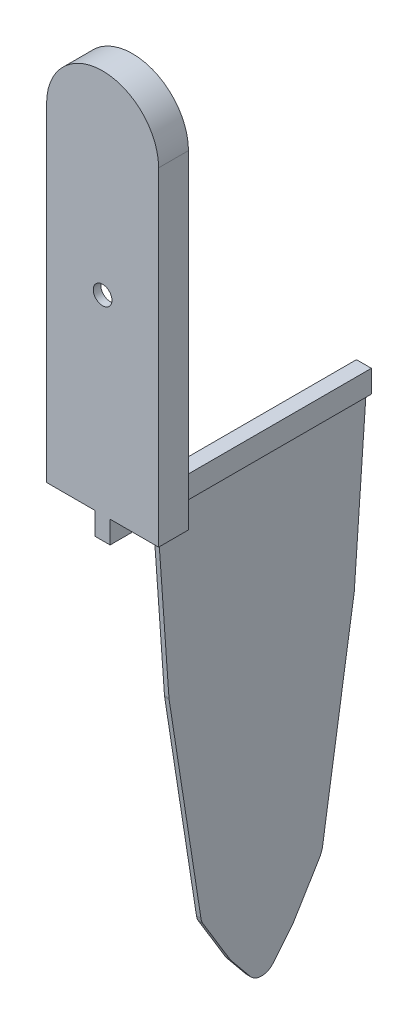
ISO-10303-21;
HEADER;
FILE_DESCRIPTION(('STEP AP214'),'2;1');
FILE_NAME('part.step','',(''),(''),'','','');
FILE_SCHEMA(('AUTOMOTIVE_DESIGN { 1 0 10303 214 1 1 1 1 }'));
ENDSEC;
DATA;
#1=APPLICATION_CONTEXT('core data for automotive mechanical design processes');
#2=APPLICATION_PROTOCOL_DEFINITION('international standard','automotive_design',2000,#1);
#3=PRODUCT_CONTEXT('',#1,'mechanical');
#4=PRODUCT('Part','Part','',(#3));
#5=PRODUCT_RELATED_PRODUCT_CATEGORY('part','',(#4));
#6=PRODUCT_DEFINITION_FORMATION('','',#4);
#7=PRODUCT_DEFINITION_CONTEXT('part definition',#1,'design');
#8=PRODUCT_DEFINITION('design','',#6,#7);
#9=PRODUCT_DEFINITION_SHAPE('','',#8);
#10=(LENGTH_UNIT() NAMED_UNIT(*) SI_UNIT(.MILLI.,.METRE.));
#11=(NAMED_UNIT(*) PLANE_ANGLE_UNIT() SI_UNIT($,.RADIAN.));
#12=(NAMED_UNIT(*) SI_UNIT($,.STERADIAN.) SOLID_ANGLE_UNIT());
#13=UNCERTAINTY_MEASURE_WITH_UNIT(LENGTH_MEASURE(1.E-05),#10,'distance_accuracy_value','');
#14=(GEOMETRIC_REPRESENTATION_CONTEXT(3) GLOBAL_UNCERTAINTY_ASSIGNED_CONTEXT((#13)) GLOBAL_UNIT_ASSIGNED_CONTEXT((#10,
#11,#12)) REPRESENTATION_CONTEXT('',''));
#15=CARTESIAN_POINT('',(0.,0.,0.));
#16=DIRECTION('',(0.,0.,1.));
#17=DIRECTION('',(1.,0.,0.));
#18=AXIS2_PLACEMENT_3D('',#15,#16,#17);
#19=CARTESIAN_POINT('',(-1.,5.,4.));
#20=DIRECTION('',(0.,-1.,0.));
#21=DIRECTION('',(0.,0.,-1.));
#22=AXIS2_PLACEMENT_3D('',#19,#20,#21);
#23=PLANE('',#22);
#24=DIRECTION('',(1.,0.,0.));
#25=VECTOR('',#24,1.);
#26=CARTESIAN_POINT('',(-1.,5.,-31.));
#27=LINE('',#26,#25);
#28=CARTESIAN_POINT('',(-1.,5.,-31.));
#29=VERTEX_POINT('',#28);
#30=CARTESIAN_POINT('',(-0.3,5.,-31.));
#31=VERTEX_POINT('',#30);
#32=EDGE_CURVE('E311',#29,#31,#27,.T.);
#33=ORIENTED_EDGE('',*,*,#32,.T.);
#34=DIRECTION('',(0.,0.,1.));
#35=VECTOR('',#34,1.);
#36=CARTESIAN_POINT('',(-0.3,5.,-3.));
#37=LINE('',#36,#35);
#38=CARTESIAN_POINT('',(-0.3,5.,-3.));
#39=VERTEX_POINT('',#38);
#40=EDGE_CURVE('E60',#31,#39,#37,.T.);
#41=ORIENTED_EDGE('',*,*,#40,.T.);
#42=DIRECTION('',(-1.,0.,0.));
#43=VECTOR('',#42,1.);
#44=CARTESIAN_POINT('',(0.3,5.,-3.));
#45=LINE('',#44,#43);
#46=CARTESIAN_POINT('',(0.3,5.,-3.));
#47=VERTEX_POINT('',#46);
#48=EDGE_CURVE('E863',#47,#39,#45,.T.);
#49=ORIENTED_EDGE('',*,*,#48,.F.);
#50=DIRECTION('',(0.,0.,1.));
#51=VECTOR('',#50,1.);
#52=CARTESIAN_POINT('',(0.3,5.,-3.));
#53=LINE('',#52,#51);
#54=CARTESIAN_POINT('',(0.3,5.,-31.));
#55=VERTEX_POINT('',#54);
#56=EDGE_CURVE('E66',#55,#47,#53,.T.);
#57=ORIENTED_EDGE('',*,*,#56,.F.);
#58=CARTESIAN_POINT('',(1.,5.,-31.));
#59=VERTEX_POINT('',#58);
#60=EDGE_CURVE('E314',#55,#59,#27,.T.);
#61=ORIENTED_EDGE('',*,*,#60,.T.);
#62=DIRECTION('',(0.,0.,-1.));
#63=VECTOR('',#62,1.);
#64=CARTESIAN_POINT('',(1.,5.,4.));
#65=LINE('',#64,#63);
#66=CARTESIAN_POINT('',(1.,5.,4.));
#67=VERTEX_POINT('',#66);
#68=EDGE_CURVE('E276',#67,#59,#65,.T.);
#69=ORIENTED_EDGE('',*,*,#68,.F.);
#70=DIRECTION('',(1.,0.,0.));
#71=VECTOR('',#70,1.);
#72=CARTESIAN_POINT('',(-1.,5.,4.));
#73=LINE('',#72,#71);
#74=CARTESIAN_POINT('',(-1.,5.,4.));
#75=VERTEX_POINT('',#74);
#76=EDGE_CURVE('E307',#75,#67,#73,.T.);
#77=ORIENTED_EDGE('',*,*,#76,.F.);
#78=DIRECTION('',(0.,0.,-1.));
#79=VECTOR('',#78,1.);
#80=CARTESIAN_POINT('',(-1.,5.,4.));
#81=LINE('',#80,#79);
#82=EDGE_CURVE('E295',#75,#29,#81,.T.);
#83=ORIENTED_EDGE('',*,*,#82,.T.);
#84=EDGE_LOOP('',(#33,#41,#49,#57,#61,#69,#77,#83));
#85=FACE_BOUND('',#84,.T.);
#86=ADVANCED_FACE('F41',(#85),#23,.T.);
#87=CARTESIAN_POINT('',(-7.5,8.,4.));
#88=DIRECTION('',(0.,1.,0.));
#89=DIRECTION('',(0.,0.,1.));
#90=AXIS2_PLACEMENT_3D('',#87,#88,#89);
#91=PLANE('',#90);
#92=DIRECTION('',(0.,0.,1.));
#93=VECTOR('',#92,1.);
#94=CARTESIAN_POINT('',(1.,8.,4.));
#95=LINE('',#94,#93);
#96=CARTESIAN_POINT('',(1.,8.,0.));
#97=VERTEX_POINT('',#96);
#98=CARTESIAN_POINT('',(1.,8.,4.));
#99=VERTEX_POINT('',#98);
#100=EDGE_CURVE('E11',#97,#99,#95,.T.);
#101=ORIENTED_EDGE('',*,*,#100,.F.);
#102=DIRECTION('',(1.,0.,0.));
#103=VECTOR('',#102,1.);
#104=CARTESIAN_POINT('',(-7.5,8.,0.));
#105=LINE('',#104,#103);
#106=CARTESIAN_POINT('',(7.5,8.,0.));
#107=VERTEX_POINT('',#106);
#108=EDGE_CURVE('E407',#97,#107,#105,.T.);
#109=ORIENTED_EDGE('',*,*,#108,.T.);
#110=DIRECTION('',(0.,0.,-1.));
#111=VECTOR('',#110,1.);
#112=CARTESIAN_POINT('',(7.5,8.,4.));
#113=LINE('',#112,#111);
#114=CARTESIAN_POINT('',(7.5,8.,4.));
#115=VERTEX_POINT('',#114);
#116=EDGE_CURVE('E418',#115,#107,#113,.T.);
#117=ORIENTED_EDGE('',*,*,#116,.F.);
#118=DIRECTION('',(1.,0.,0.));
#119=VECTOR('',#118,1.);
#120=CARTESIAN_POINT('',(-7.5,8.,4.));
#121=LINE('',#120,#119);
#122=EDGE_CURVE('E392',#99,#115,#121,.T.);
#123=ORIENTED_EDGE('',*,*,#122,.F.);
#124=EDGE_LOOP('',(#101,#109,#117,#123));
#125=FACE_BOUND('',#124,.T.);
#126=ADVANCED_FACE('F456',(#125),#91,.F.);
#127=CARTESIAN_POINT('',(0.,52.,4.));
#128=DIRECTION('',(0.,0.,-1.));
#129=DIRECTION('',(-1.,0.,0.));
#130=AXIS2_PLACEMENT_3D('',#127,#128,#129);
#131=CYLINDRICAL_SURFACE('',#130,7.5);
#132=CARTESIAN_POINT('',(0.,52.,0.));
#133=DIRECTION('',(0.,0.,1.));
#134=DIRECTION('',(1.,0.,0.));
#135=AXIS2_PLACEMENT_3D('',#132,#133,#134);
#136=CIRCLE('',#135,7.5);
#137=CARTESIAN_POINT('',(7.5,52.,0.));
#138=VERTEX_POINT('',#137);
#139=CARTESIAN_POINT('',(-7.5,52.,0.));
#140=VERTEX_POINT('',#139);
#141=EDGE_CURVE('E383',#138,#140,#136,.T.);
#142=ORIENTED_EDGE('',*,*,#141,.T.);
#143=DIRECTION('',(0.,0.,-1.));
#144=VECTOR('',#143,1.);
#145=CARTESIAN_POINT('',(-7.5,52.,4.));
#146=LINE('',#145,#144);
#147=CARTESIAN_POINT('',(-7.5,52.,4.));
#148=VERTEX_POINT('',#147);
#149=EDGE_CURVE('E425',#148,#140,#146,.T.);
#150=ORIENTED_EDGE('',*,*,#149,.F.);
#151=CARTESIAN_POINT('',(0.,52.,4.));
#152=DIRECTION('',(0.,0.,1.));
#153=DIRECTION('',(1.,0.,0.));
#154=AXIS2_PLACEMENT_3D('',#151,#152,#153);
#155=CIRCLE('',#154,7.5);
#156=CARTESIAN_POINT('',(7.5,52.,4.));
#157=VERTEX_POINT('',#156);
#158=EDGE_CURVE('E384',#157,#148,#155,.T.);
#159=ORIENTED_EDGE('',*,*,#158,.F.);
#160=DIRECTION('',(0.,0.,-1.));
#161=VECTOR('',#160,1.);
#162=CARTESIAN_POINT('',(7.5,52.,4.));
#163=LINE('',#162,#161);
#164=EDGE_CURVE('E400',#157,#138,#163,.T.);
#165=ORIENTED_EDGE('',*,*,#164,.T.);
#166=EDGE_LOOP('',(#142,#150,#159,#165));
#167=FACE_BOUND('',#166,.T.);
#168=ADVANCED_FACE('F43',(#167),#131,.T.);
#169=CARTESIAN_POINT('',(-7.5,8.,4.));
#170=DIRECTION('',(1.,0.,0.));
#171=DIRECTION('',(0.,0.,-1.));
#172=AXIS2_PLACEMENT_3D('',#169,#170,#171);
#173=PLANE('',#172);
#174=DIRECTION('',(0.,-1.,0.));
#175=VECTOR('',#174,1.);
#176=CARTESIAN_POINT('',(-7.5,8.,0.));
#177=LINE('',#176,#175);
#178=CARTESIAN_POINT('',(-7.5,8.,0.));
#179=VERTEX_POINT('',#178);
#180=EDGE_CURVE('E404',#140,#179,#177,.T.);
#181=ORIENTED_EDGE('',*,*,#180,.T.);
#182=DIRECTION('',(0.,0.,-1.));
#183=VECTOR('',#182,1.);
#184=CARTESIAN_POINT('',(-7.5,8.,4.));
#185=LINE('',#184,#183);
#186=CARTESIAN_POINT('',(-7.5,8.,4.));
#187=VERTEX_POINT('',#186);
#188=EDGE_CURVE('E422',#187,#179,#185,.T.);
#189=ORIENTED_EDGE('',*,*,#188,.F.);
#190=DIRECTION('',(0.,-1.,0.));
#191=VECTOR('',#190,1.);
#192=CARTESIAN_POINT('',(-7.5,8.,4.));
#193=LINE('',#192,#191);
#194=EDGE_CURVE('E388',#148,#187,#193,.T.);
#195=ORIENTED_EDGE('',*,*,#194,.F.);
#196=ORIENTED_EDGE('',*,*,#149,.T.);
#197=EDGE_LOOP('',(#181,#189,#195,#196));
#198=FACE_BOUND('',#197,.T.);
#199=ADVANCED_FACE('F442',(#198),#173,.F.);
#200=CARTESIAN_POINT('',(-1.,8.,0.));
#201=VERTEX_POINT('',#200);
#202=EDGE_CURVE('E408',#179,#201,#105,.T.);
#203=ORIENTED_EDGE('',*,*,#202,.T.);
#204=DIRECTION('',(0.,0.,1.));
#205=VECTOR('',#204,1.);
#206=CARTESIAN_POINT('',(-1.,8.,4.));
#207=LINE('',#206,#205);
#208=CARTESIAN_POINT('',(-1.,8.,4.));
#209=VERTEX_POINT('',#208);
#210=EDGE_CURVE('E51',#201,#209,#207,.T.);
#211=ORIENTED_EDGE('',*,*,#210,.T.);
#212=EDGE_CURVE('E393',#187,#209,#121,.T.);
#213=ORIENTED_EDGE('',*,*,#212,.F.);
#214=ORIENTED_EDGE('',*,*,#188,.T.);
#215=EDGE_LOOP('',(#203,#211,#213,#214));
#216=FACE_BOUND('',#215,.T.);
#217=ADVANCED_FACE('F434',(#216),#91,.F.);
#218=CARTESIAN_POINT('',(7.5,8.,4.));
#219=DIRECTION('',(-1.,0.,0.));
#220=DIRECTION('',(0.,0.,1.));
#221=AXIS2_PLACEMENT_3D('',#218,#219,#220);
#222=PLANE('',#221);
#223=DIRECTION('',(0.,1.,0.));
#224=VECTOR('',#223,1.);
#225=CARTESIAN_POINT('',(7.5,8.,0.));
#226=LINE('',#225,#224);
#227=EDGE_CURVE('E389',#107,#138,#226,.T.);
#228=ORIENTED_EDGE('',*,*,#227,.T.);
#229=ORIENTED_EDGE('',*,*,#164,.F.);
#230=DIRECTION('',(0.,1.,0.));
#231=VECTOR('',#230,1.);
#232=CARTESIAN_POINT('',(7.5,8.,4.));
#233=LINE('',#232,#231);
#234=EDGE_CURVE('E397',#115,#157,#233,.T.);
#235=ORIENTED_EDGE('',*,*,#234,.F.);
#236=ORIENTED_EDGE('',*,*,#116,.T.);
#237=EDGE_LOOP('',(#228,#229,#235,#236));
#238=FACE_BOUND('',#237,.T.);
#239=ADVANCED_FACE('F460',(#238),#222,.F.);
#240=CARTESIAN_POINT('',(0.,52.,4.));
#241=DIRECTION('',(0.,0.,1.));
#242=DIRECTION('',(1.,0.,0.));
#243=AXIS2_PLACEMENT_3D('',#240,#241,#242);
#244=PLANE('',#243);
#245=CARTESIAN_POINT('',(0.,33.5,4.));
#246=DIRECTION('',(0.,0.,1.));
#247=DIRECTION('',(1.,0.,0.));
#248=AXIS2_PLACEMENT_3D('',#245,#246,#247);
#249=CIRCLE('',#248,1.25);
#250=CARTESIAN_POINT('',(1.25,33.5,4.));
#251=VERTEX_POINT('',#250);
#252=EDGE_CURVE('E317',#251,#251,#249,.F.);
#253=ORIENTED_EDGE('',*,*,#252,.T.);
#254=EDGE_LOOP('',(#253));
#255=FACE_BOUND('',#254,.T.);
#256=ORIENTED_EDGE('',*,*,#158,.T.);
#257=ORIENTED_EDGE('',*,*,#194,.T.);
#258=ORIENTED_EDGE('',*,*,#212,.T.);
#259=DIRECTION('',(0.,-1.,0.));
#260=VECTOR('',#259,1.);
#261=CARTESIAN_POINT('',(-1.,8.,4.));
#262=LINE('',#261,#260);
#263=EDGE_CURVE('E291',#209,#75,#262,.T.);
#264=ORIENTED_EDGE('',*,*,#263,.T.);
#265=ORIENTED_EDGE('',*,*,#76,.T.);
#266=DIRECTION('',(0.,-1.,0.));
#267=VECTOR('',#266,1.);
#268=CARTESIAN_POINT('',(1.,8.,4.));
#269=LINE('',#268,#267);
#270=EDGE_CURVE('E271',#99,#67,#269,.T.);
#271=ORIENTED_EDGE('',*,*,#270,.F.);
#272=ORIENTED_EDGE('',*,*,#122,.T.);
#273=ORIENTED_EDGE('',*,*,#234,.T.);
#274=EDGE_LOOP('',(#256,#257,#258,#264,#265,#271,#272,#273));
#275=FACE_BOUND('',#274,.T.);
#276=ADVANCED_FACE('F439',(#255,#275),#244,.T.);
#277=CARTESIAN_POINT('',(0.,52.,0.));
#278=DIRECTION('',(0.,0.,1.));
#279=DIRECTION('',(1.,0.,0.));
#280=AXIS2_PLACEMENT_3D('',#277,#278,#279);
#281=PLANE('',#280);
#282=DIRECTION('',(-0.161684528353419,0.986842496699009,0.));
#283=VECTOR('',#282,1.);
#284=CARTESIAN_POINT('',(10.214455548325,1.67353902293651,0.));
#285=LINE('',#284,#283);
#286=CARTESIAN_POINT('',(5.,33.5,0.));
#287=VERTEX_POINT('',#286);
#288=CARTESIAN_POINT('',(2.29663575823377,50.,0.));
#289=VERTEX_POINT('',#288);
#290=EDGE_CURVE('E327',#287,#289,#285,.T.);
#291=ORIENTED_EDGE('',*,*,#290,.T.);
#292=CARTESIAN_POINT('',(0.,50.,0.));
#293=DIRECTION('',(0.,0.,1.));
#294=DIRECTION('',(1.,0.,0.));
#295=AXIS2_PLACEMENT_3D('',#292,#293,#294);
#296=CIRCLE('',#295,2.29663575823377);
#297=CARTESIAN_POINT('',(-2.29663575823377,50.,0.));
#298=VERTEX_POINT('',#297);
#299=EDGE_CURVE('E321',#298,#289,#296,.F.);
#300=ORIENTED_EDGE('',*,*,#299,.F.);
#301=DIRECTION('',(-0.161684528353419,-0.986842496699009,0.));
#302=VECTOR('',#301,1.);
#303=CARTESIAN_POINT('',(-10.214455548325,1.67353902293651,0.));
#304=LINE('',#303,#302);
#305=CARTESIAN_POINT('',(-5.,33.5,0.));
#306=VERTEX_POINT('',#305);
#307=EDGE_CURVE('E346',#298,#306,#304,.T.);
#308=ORIENTED_EDGE('',*,*,#307,.T.);
#309=DIRECTION('',(0.161380696641222,-0.986892228539466,0.));
#310=VECTOR('',#309,1.);
#311=CARTESIAN_POINT('',(0.465608050517505,0.0761381530640669,0.));
#312=LINE('',#311,#310);
#313=CARTESIAN_POINT('',(-2.30185179538713,17.,0.));
#314=VERTEX_POINT('',#313);
#315=EDGE_CURVE('E350',#306,#314,#312,.T.);
#316=ORIENTED_EDGE('',*,*,#315,.T.);
#317=CARTESIAN_POINT('',(0.,17.,0.));
#318=DIRECTION('',(0.,0.,1.));
#319=DIRECTION('',(1.,0.,0.));
#320=AXIS2_PLACEMENT_3D('',#317,#318,#319);
#321=CIRCLE('',#320,2.30185179538713);
#322=CARTESIAN_POINT('',(2.27233199291966,16.6325370741411,0.));
#323=VERTEX_POINT('',#322);
#324=EDGE_CURVE('E354',#314,#323,#321,.T.);
#325=ORIENTED_EDGE('',*,*,#324,.T.);
#326=DIRECTION('',(-0.159637960443524,-0.987175628541057,0.));
#327=VECTOR('',#326,1.);
#328=CARTESIAN_POINT('',(-0.40670997405777,0.0657698071887931,0.));
#329=LINE('',#328,#327);
#330=EDGE_CURVE('E358',#287,#323,#329,.T.);
#331=ORIENTED_EDGE('',*,*,#330,.F.);
#332=EDGE_LOOP('',(#291,#300,#308,#316,#325,#331));
#333=FACE_BOUND('',#332,.T.);
#334=ORIENTED_EDGE('',*,*,#141,.F.);
#335=ORIENTED_EDGE('',*,*,#227,.F.);
#336=ORIENTED_EDGE('',*,*,#108,.F.);
#337=EDGE_CURVE('E412',#201,#97,#105,.T.);
#338=ORIENTED_EDGE('',*,*,#337,.F.);
#339=ORIENTED_EDGE('',*,*,#202,.F.);
#340=ORIENTED_EDGE('',*,*,#180,.F.);
#341=EDGE_LOOP('',(#334,#335,#336,#338,#339,#340));
#342=FACE_BOUND('',#341,.T.);
#343=ADVANCED_FACE('F446',(#333,#342),#281,.F.);
#344=CARTESIAN_POINT('',(0.,50.,3.));
#345=DIRECTION('',(0.,0.,-1.));
#346=DIRECTION('',(-1.,0.,0.));
#347=AXIS2_PLACEMENT_3D('',#344,#345,#346);
#348=CYLINDRICAL_SURFACE('',#347,2.29663575823377);
#349=ORIENTED_EDGE('',*,*,#299,.T.);
#350=DIRECTION('',(0.,0.,-1.));
#351=VECTOR('',#350,1.);
#352=CARTESIAN_POINT('',(2.29663575823377,50.,3.));
#353=LINE('',#352,#351);
#354=CARTESIAN_POINT('',(2.29663575823377,50.,3.));
#355=VERTEX_POINT('',#354);
#356=EDGE_CURVE('E343',#355,#289,#353,.T.);
#357=ORIENTED_EDGE('',*,*,#356,.F.);
#358=CARTESIAN_POINT('',(0.,50.,3.));
#359=DIRECTION('',(0.,0.,1.));
#360=DIRECTION('',(1.,0.,0.));
#361=AXIS2_PLACEMENT_3D('',#358,#359,#360);
#362=CIRCLE('',#361,2.29663575823377);
#363=CARTESIAN_POINT('',(-2.29663575823377,50.,3.));
#364=VERTEX_POINT('',#363);
#365=EDGE_CURVE('E322',#364,#355,#362,.F.);
#366=ORIENTED_EDGE('',*,*,#365,.F.);
#367=DIRECTION('',(0.,0.,-1.));
#368=VECTOR('',#367,1.);
#369=CARTESIAN_POINT('',(-2.29663575823377,50.,3.));
#370=LINE('',#369,#368);
#371=EDGE_CURVE('E380',#364,#298,#370,.T.);
#372=ORIENTED_EDGE('',*,*,#371,.T.);
#373=EDGE_LOOP('',(#349,#357,#366,#372));
#374=FACE_BOUND('',#373,.T.);
#375=ADVANCED_FACE('F505',(#374),#348,.F.);
#376=CARTESIAN_POINT('',(-10.214455548325,1.67353902293651,3.));
#377=DIRECTION('',(0.986842496699008,-0.161684528353419,0.));
#378=DIRECTION('',(0.161684528353419,0.986842496699008,0.));
#379=AXIS2_PLACEMENT_3D('',#376,#377,#378);
#380=PLANE('',#379);
#381=ORIENTED_EDGE('',*,*,#307,.F.);
#382=ORIENTED_EDGE('',*,*,#371,.F.);
#383=DIRECTION('',(-0.161684528353419,-0.986842496699009,0.));
#384=VECTOR('',#383,1.);
#385=CARTESIAN_POINT('',(-10.214455548325,1.67353902293651,3.));
#386=LINE('',#385,#384);
#387=CARTESIAN_POINT('',(-5.,33.5,3.));
#388=VERTEX_POINT('',#387);
#389=EDGE_CURVE('E326',#364,#388,#386,.T.);
#390=ORIENTED_EDGE('',*,*,#389,.T.);
#391=DIRECTION('',(0.,0.,-1.));
#392=VECTOR('',#391,1.);
#393=CARTESIAN_POINT('',(-5.,33.5,3.));
#394=LINE('',#393,#392);
#395=EDGE_CURVE('E377',#388,#306,#394,.T.);
#396=ORIENTED_EDGE('',*,*,#395,.T.);
#397=EDGE_LOOP('',(#381,#382,#390,#396));
#398=FACE_BOUND('',#397,.T.);
#399=ADVANCED_FACE('F501',(#398),#380,.T.);
#400=CARTESIAN_POINT('',(0.465608050517505,0.0761381530640669,3.));
#401=DIRECTION('',(0.986892228539466,0.161380696641222,0.));
#402=DIRECTION('',(-0.161380696641222,0.986892228539466,0.));
#403=AXIS2_PLACEMENT_3D('',#400,#401,#402);
#404=PLANE('',#403);
#405=ORIENTED_EDGE('',*,*,#315,.F.);
#406=ORIENTED_EDGE('',*,*,#395,.F.);
#407=DIRECTION('',(0.161380696641222,-0.986892228539466,0.));
#408=VECTOR('',#407,1.);
#409=CARTESIAN_POINT('',(0.465608050517505,0.0761381530640669,3.));
#410=LINE('',#409,#408);
#411=CARTESIAN_POINT('',(-2.30185179538713,17.,3.));
#412=VERTEX_POINT('',#411);
#413=EDGE_CURVE('E330',#388,#412,#410,.T.);
#414=ORIENTED_EDGE('',*,*,#413,.T.);
#415=DIRECTION('',(0.,0.,-1.));
#416=VECTOR('',#415,1.);
#417=CARTESIAN_POINT('',(-2.30185179538713,17.,3.));
#418=LINE('',#417,#416);
#419=EDGE_CURVE('E374',#412,#314,#418,.T.);
#420=ORIENTED_EDGE('',*,*,#419,.T.);
#421=EDGE_LOOP('',(#405,#406,#414,#420));
#422=FACE_BOUND('',#421,.T.);
#423=ADVANCED_FACE('F497',(#422),#404,.T.);
#424=CARTESIAN_POINT('',(0.,17.,3.));
#425=DIRECTION('',(0.,0.,-1.));
#426=DIRECTION('',(-1.,0.,0.));
#427=AXIS2_PLACEMENT_3D('',#424,#425,#426);
#428=CYLINDRICAL_SURFACE('',#427,2.30185179538713);
#429=ORIENTED_EDGE('',*,*,#324,.F.);
#430=ORIENTED_EDGE('',*,*,#419,.F.);
#431=CARTESIAN_POINT('',(0.,17.,3.));
#432=DIRECTION('',(0.,0.,1.));
#433=DIRECTION('',(1.,0.,0.));
#434=AXIS2_PLACEMENT_3D('',#431,#432,#433);
#435=CIRCLE('',#434,2.30185179538713);
#436=CARTESIAN_POINT('',(2.27233199291966,16.6325370741411,3.));
#437=VERTEX_POINT('',#436);
#438=EDGE_CURVE('E333',#412,#437,#435,.T.);
#439=ORIENTED_EDGE('',*,*,#438,.T.);
#440=DIRECTION('',(0.,0.,-1.));
#441=VECTOR('',#440,1.);
#442=CARTESIAN_POINT('',(2.27233199291966,16.6325370741411,3.));
#443=LINE('',#442,#441);
#444=EDGE_CURVE('E371',#437,#323,#443,.T.);
#445=ORIENTED_EDGE('',*,*,#444,.T.);
#446=EDGE_LOOP('',(#429,#430,#439,#445));
#447=FACE_BOUND('',#446,.T.);
#448=ADVANCED_FACE('F493',(#447),#428,.F.);
#449=CARTESIAN_POINT('',(-0.40670997405777,0.0657698071887931,3.));
#450=DIRECTION('',(0.987175628541057,-0.159637960443524,0.));
#451=DIRECTION('',(0.159637960443524,0.987175628541057,0.));
#452=AXIS2_PLACEMENT_3D('',#449,#450,#451);
#453=PLANE('',#452);
#454=ORIENTED_EDGE('',*,*,#330,.T.);
#455=ORIENTED_EDGE('',*,*,#444,.F.);
#456=DIRECTION('',(-0.159637960443524,-0.987175628541057,0.));
#457=VECTOR('',#456,1.);
#458=CARTESIAN_POINT('',(-0.40670997405777,0.0657698071887931,3.));
#459=LINE('',#458,#457);
#460=CARTESIAN_POINT('',(5.,33.5,3.));
#461=VERTEX_POINT('',#460);
#462=EDGE_CURVE('E336',#461,#437,#459,.T.);
#463=ORIENTED_EDGE('',*,*,#462,.F.);
#464=DIRECTION('',(0.,0.,-1.));
#465=VECTOR('',#464,1.);
#466=CARTESIAN_POINT('',(5.,33.5,3.));
#467=LINE('',#466,#465);
#468=EDGE_CURVE('E368',#461,#287,#467,.T.);
#469=ORIENTED_EDGE('',*,*,#468,.T.);
#470=EDGE_LOOP('',(#454,#455,#463,#469));
#471=FACE_BOUND('',#470,.T.);
#472=ADVANCED_FACE('F489',(#471),#453,.F.);
#473=CARTESIAN_POINT('',(10.214455548325,1.67353902293651,3.));
#474=DIRECTION('',(-0.986842496699008,-0.161684528353419,0.));
#475=DIRECTION('',(0.161684528353419,-0.986842496699008,0.));
#476=AXIS2_PLACEMENT_3D('',#473,#474,#475);
#477=PLANE('',#476);
#478=ORIENTED_EDGE('',*,*,#290,.F.);
#479=ORIENTED_EDGE('',*,*,#468,.F.);
#480=DIRECTION('',(-0.161684528353419,0.986842496699009,0.));
#481=VECTOR('',#480,1.);
#482=CARTESIAN_POINT('',(10.214455548325,1.67353902293651,3.));
#483=LINE('',#482,#481);
#484=EDGE_CURVE('E340',#461,#355,#483,.T.);
#485=ORIENTED_EDGE('',*,*,#484,.T.);
#486=ORIENTED_EDGE('',*,*,#356,.T.);
#487=EDGE_LOOP('',(#478,#479,#485,#486));
#488=FACE_BOUND('',#487,.T.);
#489=ADVANCED_FACE('F485',(#488),#477,.T.);
#490=CARTESIAN_POINT('',(0.,0.,3.));
#491=DIRECTION('',(0.,0.,1.));
#492=DIRECTION('',(1.,0.,0.));
#493=AXIS2_PLACEMENT_3D('',#490,#491,#492);
#494=PLANE('',#493);
#495=CARTESIAN_POINT('',(0.,33.5,3.));
#496=DIRECTION('',(0.,0.,1.));
#497=DIRECTION('',(1.,0.,0.));
#498=AXIS2_PLACEMENT_3D('',#495,#496,#497);
#499=CIRCLE('',#498,1.25);
#500=CARTESIAN_POINT('',(1.25,33.5,3.));
#501=VERTEX_POINT('',#500);
#502=EDGE_CURVE('E45',#501,#501,#499,.F.);
#503=ORIENTED_EDGE('',*,*,#502,.F.);
#504=EDGE_LOOP('',(#503));
#505=FACE_BOUND('',#504,.T.);
#506=ORIENTED_EDGE('',*,*,#365,.T.);
#507=ORIENTED_EDGE('',*,*,#484,.F.);
#508=ORIENTED_EDGE('',*,*,#462,.T.);
#509=ORIENTED_EDGE('',*,*,#438,.F.);
#510=ORIENTED_EDGE('',*,*,#413,.F.);
#511=ORIENTED_EDGE('',*,*,#389,.F.);
#512=EDGE_LOOP('',(#506,#507,#508,#509,#510,#511));
#513=FACE_BOUND('',#512,.T.);
#514=ADVANCED_FACE('F481',(#505,#513),#494,.F.);
#515=CARTESIAN_POINT('',(0.,33.5,12.4));
#516=DIRECTION('',(0.,0.,-1.));
#517=DIRECTION('',(-1.,0.,0.));
#518=AXIS2_PLACEMENT_3D('',#515,#516,#517);
#519=CYLINDRICAL_SURFACE('',#518,1.25);
#520=ORIENTED_EDGE('',*,*,#252,.F.);
#521=EDGE_LOOP('',(#520));
#522=FACE_BOUND('',#521,.T.);
#523=ORIENTED_EDGE('',*,*,#502,.T.);
#524=EDGE_LOOP('',(#523));
#525=FACE_BOUND('',#524,.T.);
#526=ADVANCED_FACE('F477',(#522,#525),#519,.F.);
#527=CARTESIAN_POINT('',(-1.,8.,4.));
#528=DIRECTION('',(0.,1.,0.));
#529=DIRECTION('',(0.,0.,1.));
#530=AXIS2_PLACEMENT_3D('',#527,#528,#529);
#531=PLANE('',#530);
#532=CARTESIAN_POINT('',(-1.,8.,-31.));
#533=VERTEX_POINT('',#532);
#534=EDGE_CURVE('E303',#533,#201,#207,.T.);
#535=ORIENTED_EDGE('',*,*,#534,.T.);
#536=ORIENTED_EDGE('',*,*,#337,.T.);
#537=CARTESIAN_POINT('',(1.,8.,-31.));
#538=VERTEX_POINT('',#537);
#539=EDGE_CURVE('E53',#538,#97,#95,.T.);
#540=ORIENTED_EDGE('',*,*,#539,.F.);
#541=DIRECTION('',(1.,0.,0.));
#542=VECTOR('',#541,1.);
#543=CARTESIAN_POINT('',(-1.,8.,-31.));
#544=LINE('',#543,#542);
#545=EDGE_CURVE('E308',#533,#538,#544,.T.);
#546=ORIENTED_EDGE('',*,*,#545,.F.);
#547=EDGE_LOOP('',(#535,#536,#540,#546));
#548=FACE_BOUND('',#547,.T.);
#549=ADVANCED_FACE('F480',(#548),#531,.T.);
#550=CARTESIAN_POINT('',(-1.,8.,-31.));
#551=DIRECTION('',(0.,0.,-1.));
#552=DIRECTION('',(-1.,0.,0.));
#553=AXIS2_PLACEMENT_3D('',#550,#551,#552);
#554=PLANE('',#553);
#555=ORIENTED_EDGE('',*,*,#545,.T.);
#556=DIRECTION('',(0.,1.,0.));
#557=VECTOR('',#556,1.);
#558=CARTESIAN_POINT('',(1.,8.,-31.));
#559=LINE('',#558,#557);
#560=EDGE_CURVE('E285',#59,#538,#559,.T.);
#561=ORIENTED_EDGE('',*,*,#560,.F.);
#562=ORIENTED_EDGE('',*,*,#60,.F.);
#563=DIRECTION('',(-1.,0.,0.));
#564=VECTOR('',#563,1.);
#565=CARTESIAN_POINT('',(0.3,5.,-31.));
#566=LINE('',#565,#564);
#567=EDGE_CURVE('E866',#55,#31,#566,.T.);
#568=ORIENTED_EDGE('',*,*,#567,.T.);
#569=ORIENTED_EDGE('',*,*,#32,.F.);
#570=DIRECTION('',(0.,1.,0.));
#571=VECTOR('',#570,1.);
#572=CARTESIAN_POINT('',(-1.,8.,-31.));
#573=LINE('',#572,#571);
#574=EDGE_CURVE('E299',#29,#533,#573,.T.);
#575=ORIENTED_EDGE('',*,*,#574,.T.);
#576=EDGE_LOOP('',(#555,#561,#562,#568,#569,#575));
#577=FACE_BOUND('',#576,.T.);
#578=ADVANCED_FACE('F475',(#577),#554,.T.);
#579=CARTESIAN_POINT('',(-1.,0.,0.));
#580=DIRECTION('',(1.,0.,0.));
#581=DIRECTION('',(0.,0.,-1.));
#582=AXIS2_PLACEMENT_3D('',#579,#580,#581);
#583=PLANE('',#582);
#584=ORIENTED_EDGE('',*,*,#263,.F.);
#585=ORIENTED_EDGE('',*,*,#210,.F.);
#586=ORIENTED_EDGE('',*,*,#534,.F.);
#587=ORIENTED_EDGE('',*,*,#574,.F.);
#588=ORIENTED_EDGE('',*,*,#82,.F.);
#589=EDGE_LOOP('',(#584,#585,#586,#587,#588));
#590=FACE_BOUND('',#589,.T.);
#591=ADVANCED_FACE('F579',(#590),#583,.F.);
#592=CARTESIAN_POINT('',(1.,0.,0.));
#593=DIRECTION('',(1.,0.,0.));
#594=DIRECTION('',(0.,0.,-1.));
#595=AXIS2_PLACEMENT_3D('',#592,#593,#594);
#596=PLANE('',#595);
#597=ORIENTED_EDGE('',*,*,#270,.T.);
#598=ORIENTED_EDGE('',*,*,#68,.T.);
#599=ORIENTED_EDGE('',*,*,#560,.T.);
#600=ORIENTED_EDGE('',*,*,#539,.T.);
#601=ORIENTED_EDGE('',*,*,#100,.T.);
#602=EDGE_LOOP('',(#597,#598,#599,#600,#601));
#603=FACE_BOUND('',#602,.T.);
#604=ADVANCED_FACE('F586',(#603),#596,.T.);
#605=CARTESIAN_POINT('',(0.3,5.,-3.));
#606=DIRECTION('',(0.,0.0707004700109633,-0.997497590744072));
#607=DIRECTION('',(0.,0.997497590744073,0.0707004700109633));
#608=AXIS2_PLACEMENT_3D('',#605,#606,#607);
#609=PLANE('',#608);
#610=DIRECTION('',(0.,-0.997497590744072,-0.0707004700109633));
#611=VECTOR('',#610,1.);
#612=CARTESIAN_POINT('',(-0.3,5.,-3.));
#613=LINE('',#612,#611);
#614=CARTESIAN_POINT('',(-0.3,-17.3922662924585,-4.58711536366373));
#615=VERTEX_POINT('',#614);
#616=EDGE_CURVE('E269',#39,#615,#613,.T.);
#617=ORIENTED_EDGE('',*,*,#616,.T.);
#618=DIRECTION('',(-1.,0.,0.));
#619=VECTOR('',#618,1.);
#620=CARTESIAN_POINT('',(0.3,-17.3922662924585,-4.58711536366373));
#621=LINE('',#620,#619);
#622=CARTESIAN_POINT('',(0.3,-17.3922662924585,-4.58711536366373));
#623=VERTEX_POINT('',#622);
#624=EDGE_CURVE('E251',#623,#615,#621,.T.);
#625=ORIENTED_EDGE('',*,*,#624,.F.);
#626=DIRECTION('',(0.,-0.997497590744072,-0.0707004700109633));
#627=VECTOR('',#626,1.);
#628=CARTESIAN_POINT('',(0.3,5.,-3.));
#629=LINE('',#628,#627);
#630=EDGE_CURVE('E259',#47,#623,#629,.T.);
#631=ORIENTED_EDGE('',*,*,#630,.F.);
#632=ORIENTED_EDGE('',*,*,#48,.T.);
#633=EDGE_LOOP('',(#617,#625,#631,#632));
#634=FACE_BOUND('',#633,.T.);
#635=ADVANCED_FACE('F267',(#634),#609,.F.);
#636=CARTESIAN_POINT('',(0.3,-17.2508653524366,-6.58211054515187));
#637=DIRECTION('',(-1.,0.,0.));
#638=DIRECTION('',(0.,0.,1.));
#639=AXIS2_PLACEMENT_3D('',#636,#637,#638);
#640=CYLINDRICAL_SURFACE('',#639,2.);
#641=CARTESIAN_POINT('',(-0.3,-17.2508653524366,-6.58211054515187));
#642=DIRECTION('',(1.,0.,0.));
#643=DIRECTION('',(0.,0.,1.));
#644=AXIS2_PLACEMENT_3D('',#641,#642,#643);
#645=CIRCLE('',#644,2.);
#646=CARTESIAN_POINT('',(-0.3,-17.5571208508871,-4.60569774169486));
#647=VERTEX_POINT('',#646);
#648=EDGE_CURVE('E813',#615,#647,#645,.T.);
#649=ORIENTED_EDGE('',*,*,#648,.T.);
#650=DIRECTION('',(-1.,0.,0.));
#651=VECTOR('',#650,1.);
#652=CARTESIAN_POINT('',(0.3,-17.5571208508871,-4.60569774169486));
#653=LINE('',#652,#651);
#654=CARTESIAN_POINT('',(0.3,-17.5571208508871,-4.60569774169486));
#655=VERTEX_POINT('',#654);
#656=EDGE_CURVE('E254',#655,#647,#653,.T.);
#657=ORIENTED_EDGE('',*,*,#656,.F.);
#658=CARTESIAN_POINT('',(0.3,-17.2508653524366,-6.58211054515187));
#659=DIRECTION('',(1.,0.,0.));
#660=DIRECTION('',(0.,0.,1.));
#661=AXIS2_PLACEMENT_3D('',#658,#659,#660);
#662=CIRCLE('',#661,2.);
#663=EDGE_CURVE('E247',#623,#655,#662,.T.);
#664=ORIENTED_EDGE('',*,*,#663,.F.);
#665=ORIENTED_EDGE('',*,*,#624,.T.);
#666=EDGE_LOOP('',(#649,#657,#664,#665));
#667=FACE_BOUND('',#666,.T.);
#668=ADVANCED_FACE('F249',(#667),#640,.T.);
#669=CARTESIAN_POINT('',(0.3,-17.5571208508871,-4.60569774169486));
#670=DIRECTION('',(0.,0.153127749225257,-0.988206401728509));
#671=DIRECTION('',(0.,0.988206401728509,0.153127749225257));
#672=AXIS2_PLACEMENT_3D('',#669,#670,#671);
#673=PLANE('',#672);
#674=DIRECTION('',(0.,-0.988206401728509,-0.153127749225257));
#675=VECTOR('',#674,1.);
#676=CARTESIAN_POINT('',(-0.3,-17.5571208508871,-4.60569774169486));
#677=LINE('',#676,#675);
#678=CARTESIAN_POINT('',(-0.3,-45.1023059867737,-8.87396821077255));
#679=VERTEX_POINT('',#678);
#680=EDGE_CURVE('E817',#647,#679,#677,.T.);
#681=ORIENTED_EDGE('',*,*,#680,.T.);
#682=DIRECTION('',(-1.,0.,0.));
#683=VECTOR('',#682,1.);
#684=CARTESIAN_POINT('',(0.3,-45.1023059867737,-8.87396821077255));
#685=LINE('',#684,#683);
#686=CARTESIAN_POINT('',(0.3,-45.1023059867737,-8.87396821077255));
#687=VERTEX_POINT('',#686);
#688=EDGE_CURVE('E278',#687,#679,#685,.T.);
#689=ORIENTED_EDGE('',*,*,#688,.F.);
#690=DIRECTION('',(0.,-0.988206401728509,-0.153127749225257));
#691=VECTOR('',#690,1.);
#692=CARTESIAN_POINT('',(0.3,-17.5571208508871,-4.60569774169486));
#693=LINE('',#692,#691);
#694=EDGE_CURVE('E258',#655,#687,#693,.T.);
#695=ORIENTED_EDGE('',*,*,#694,.F.);
#696=ORIENTED_EDGE('',*,*,#656,.T.);
#697=EDGE_LOOP('',(#681,#689,#695,#696));
#698=FACE_BOUND('',#697,.T.);
#699=ADVANCED_FACE('F605',(#698),#673,.F.);
#700=CARTESIAN_POINT('',(0.3,-44.7960504883232,-10.8503810142296));
#701=DIRECTION('',(-1.,0.,0.));
#702=DIRECTION('',(0.,0.,1.));
#703=AXIS2_PLACEMENT_3D('',#700,#701,#702);
#704=CYLINDRICAL_SURFACE('',#703,2.);
#705=CARTESIAN_POINT('',(-0.3,-44.7960504883232,-10.8503810142296));
#706=DIRECTION('',(1.,0.,0.));
#707=DIRECTION('',(0.,0.,1.));
#708=AXIS2_PLACEMENT_3D('',#705,#706,#707);
#709=CIRCLE('',#708,2.);
#710=CARTESIAN_POINT('',(-0.3,-45.8345928087644,-9.14116193855422));
#711=VERTEX_POINT('',#710);
#712=EDGE_CURVE('E824',#679,#711,#709,.T.);
#713=ORIENTED_EDGE('',*,*,#712,.T.);
#714=DIRECTION('',(-1.,0.,0.));
#715=VECTOR('',#714,1.);
#716=CARTESIAN_POINT('',(0.3,-45.8345928087644,-9.14116193855422));
#717=LINE('',#716,#715);
#718=CARTESIAN_POINT('',(0.3,-45.8345928087644,-9.14116193855422));
#719=VERTEX_POINT('',#718);
#720=EDGE_CURVE('E909',#719,#711,#717,.T.);
#721=ORIENTED_EDGE('',*,*,#720,.F.);
#722=CARTESIAN_POINT('',(0.3,-44.7960504883232,-10.8503810142296));
#723=DIRECTION('',(1.,0.,0.));
#724=DIRECTION('',(0.,0.,1.));
#725=AXIS2_PLACEMENT_3D('',#722,#723,#724);
#726=CIRCLE('',#725,2.);
#727=EDGE_CURVE('E918',#687,#719,#726,.T.);
#728=ORIENTED_EDGE('',*,*,#727,.F.);
#729=ORIENTED_EDGE('',*,*,#688,.T.);
#730=EDGE_LOOP('',(#713,#721,#728,#729));
#731=FACE_BOUND('',#730,.T.);
#732=ADVANCED_FACE('F612',(#731),#704,.T.);
#733=CARTESIAN_POINT('',(0.3,-45.8345928087644,-9.14116193855422));
#734=DIRECTION('',(0.,0.519271160220619,-0.854609537837679));
#735=DIRECTION('',(0.,0.854609537837679,0.519271160220619));
#736=AXIS2_PLACEMENT_3D('',#733,#734,#735);
#737=PLANE('',#736);
#738=DIRECTION('',(0.,-0.854609537837679,-0.519271160220619));
#739=VECTOR('',#738,1.);
#740=CARTESIAN_POINT('',(-0.3,-45.8345928087644,-9.14116193855422));
#741=LINE('',#740,#739);
#742=CARTESIAN_POINT('',(-0.3,-51.7750752134062,-12.7506713740953));
#743=VERTEX_POINT('',#742);
#744=EDGE_CURVE('E827',#711,#743,#741,.T.);
#745=ORIENTED_EDGE('',*,*,#744,.T.);
#746=DIRECTION('',(-1.,0.,0.));
#747=VECTOR('',#746,1.);
#748=CARTESIAN_POINT('',(0.3,-51.7750752134062,-12.7506713740953));
#749=LINE('',#748,#747);
#750=CARTESIAN_POINT('',(0.3,-51.7750752134062,-12.7506713740953));
#751=VERTEX_POINT('',#750);
#752=EDGE_CURVE('E905',#751,#743,#749,.T.);
#753=ORIENTED_EDGE('',*,*,#752,.F.);
#754=DIRECTION('',(0.,-0.854609537837679,-0.519271160220619));
#755=VECTOR('',#754,1.);
#756=CARTESIAN_POINT('',(0.3,-45.8345928087644,-9.14116193855422));
#757=LINE('',#756,#755);
#758=EDGE_CURVE('E930',#719,#751,#757,.T.);
#759=ORIENTED_EDGE('',*,*,#758,.F.);
#760=ORIENTED_EDGE('',*,*,#720,.T.);
#761=EDGE_LOOP('',(#745,#753,#759,#760));
#762=FACE_BOUND('',#761,.T.);
#763=ADVANCED_FACE('F620',(#762),#737,.F.);
#764=CARTESIAN_POINT('',(0.3,-50.736532892965,-14.4598904497707));
#765=DIRECTION('',(-1.,0.,0.));
#766=DIRECTION('',(0.,0.,1.));
#767=AXIS2_PLACEMENT_3D('',#764,#765,#766);
#768=CYLINDRICAL_SURFACE('',#767,1.99999999999999);
#769=CARTESIAN_POINT('',(-0.3,-50.736532892965,-14.4598904497707));
#770=DIRECTION('',(1.,0.,0.));
#771=DIRECTION('',(0.,0.,1.));
#772=AXIS2_PLACEMENT_3D('',#769,#770,#771);
#773=CIRCLE('',#772,1.99999999999999);
#774=CARTESIAN_POINT('',(-0.3,-52.0029298933949,-12.9119115618972));
#775=VERTEX_POINT('',#774);
#776=EDGE_CURVE('E830',#743,#775,#773,.T.);
#777=ORIENTED_EDGE('',*,*,#776,.T.);
#778=DIRECTION('',(-1.,0.,0.));
#779=VECTOR('',#778,1.);
#780=CARTESIAN_POINT('',(0.3,-52.0029298933949,-12.9119115618972));
#781=LINE('',#780,#779);
#782=CARTESIAN_POINT('',(0.3,-52.0029298933949,-12.9119115618972));
#783=VERTEX_POINT('',#782);
#784=EDGE_CURVE('E901',#783,#775,#781,.T.);
#785=ORIENTED_EDGE('',*,*,#784,.F.);
#786=CARTESIAN_POINT('',(0.3,-50.736532892965,-14.4598904497707));
#787=DIRECTION('',(1.,0.,0.));
#788=DIRECTION('',(0.,0.,1.));
#789=AXIS2_PLACEMENT_3D('',#786,#787,#788);
#790=CIRCLE('',#789,1.99999999999999);
#791=EDGE_CURVE('E926',#751,#783,#790,.T.);
#792=ORIENTED_EDGE('',*,*,#791,.F.);
#793=ORIENTED_EDGE('',*,*,#752,.T.);
#794=EDGE_LOOP('',(#777,#785,#792,#793));
#795=FACE_BOUND('',#794,.T.);
#796=ADVANCED_FACE('F628',(#795),#768,.T.);
#797=CARTESIAN_POINT('',(0.3,-52.0029298933949,-12.9119115618972));
#798=DIRECTION('',(0.,0.633198500214973,-0.773989443936743));
#799=DIRECTION('',(0.,0.773989443936743,0.633198500214973));
#800=AXIS2_PLACEMENT_3D('',#797,#798,#799);
#801=PLANE('',#800);
#802=DIRECTION('',(0.,-0.773989443936743,-0.633198500214973));
#803=VECTOR('',#802,1.);
#804=CARTESIAN_POINT('',(-0.3,-52.0029298933949,-12.9119115618972));
#805=LINE('',#804,#803);
#806=CARTESIAN_POINT('',(-0.3,-55.1078298223318,-15.4520211121265));
#807=VERTEX_POINT('',#806);
#808=EDGE_CURVE('E833',#775,#807,#805,.T.);
#809=ORIENTED_EDGE('',*,*,#808,.T.);
#810=DIRECTION('',(-1.,0.,0.));
#811=VECTOR('',#810,1.);
#812=CARTESIAN_POINT('',(0.3,-55.1078298223318,-15.4520211121265));
#813=LINE('',#812,#811);
#814=CARTESIAN_POINT('',(0.3,-55.1078298223318,-15.4520211121265));
#815=VERTEX_POINT('',#814);
#816=EDGE_CURVE('E897',#815,#807,#813,.T.);
#817=ORIENTED_EDGE('',*,*,#816,.F.);
#818=DIRECTION('',(0.,-0.773989443936743,-0.633198500214973));
#819=VECTOR('',#818,1.);
#820=CARTESIAN_POINT('',(0.3,-52.0029298933949,-12.9119115618972));
#821=LINE('',#820,#819);
#822=EDGE_CURVE('E929',#783,#815,#821,.T.);
#823=ORIENTED_EDGE('',*,*,#822,.F.);
#824=ORIENTED_EDGE('',*,*,#784,.T.);
#825=EDGE_LOOP('',(#809,#817,#823,#824));
#826=FACE_BOUND('',#825,.T.);
#827=ADVANCED_FACE('F636',(#826),#801,.F.);
#828=CARTESIAN_POINT('',(0.3,-53.8414328219018,-17.));
#829=DIRECTION('',(-1.,0.,0.));
#830=DIRECTION('',(0.,0.,1.));
#831=AXIS2_PLACEMENT_3D('',#828,#829,#830);
#832=CYLINDRICAL_SURFACE('',#831,1.99999999999999);
#833=CARTESIAN_POINT('',(-0.3,-53.8414328219018,-17.));
#834=DIRECTION('',(1.,0.,0.));
#835=DIRECTION('',(0.,0.,-1.));
#836=AXIS2_PLACEMENT_3D('',#833,#834,#835);
#837=CIRCLE('',#836,1.99999999999999);
#838=CARTESIAN_POINT('',(-0.3,-55.1078298223318,-18.5479788878734));
#839=VERTEX_POINT('',#838);
#840=EDGE_CURVE('E836',#807,#839,#837,.T.);
#841=ORIENTED_EDGE('',*,*,#840,.T.);
#842=DIRECTION('',(-1.,0.,0.));
#843=VECTOR('',#842,1.);
#844=CARTESIAN_POINT('',(0.3,-55.1078298223318,-18.5479788878734));
#845=LINE('',#844,#843);
#846=CARTESIAN_POINT('',(0.3,-55.1078298223318,-18.5479788878734));
#847=VERTEX_POINT('',#846);
#848=EDGE_CURVE('E893',#847,#839,#845,.T.);
#849=ORIENTED_EDGE('',*,*,#848,.F.);
#850=CARTESIAN_POINT('',(0.3,-53.8414328219018,-17.));
#851=DIRECTION('',(1.,0.,0.));
#852=DIRECTION('',(0.,0.,-1.));
#853=AXIS2_PLACEMENT_3D('',#850,#851,#852);
#854=CIRCLE('',#853,1.99999999999999);
#855=EDGE_CURVE('E934',#815,#847,#854,.T.);
#856=ORIENTED_EDGE('',*,*,#855,.F.);
#857=ORIENTED_EDGE('',*,*,#816,.T.);
#858=EDGE_LOOP('',(#841,#849,#856,#857));
#859=FACE_BOUND('',#858,.T.);
#860=ADVANCED_FACE('F644',(#859),#832,.T.);
#861=CARTESIAN_POINT('',(0.3,-52.0029298933949,-21.0880884381028));
#862=DIRECTION('',(0.,0.633198500214975,0.773989443936742));
#863=DIRECTION('',(0.,-0.773989443936742,0.633198500214975));
#864=AXIS2_PLACEMENT_3D('',#861,#862,#863);
#865=PLANE('',#864);
#866=DIRECTION('',(0.,0.773989443936742,-0.633198500214975));
#867=VECTOR('',#866,1.);
#868=CARTESIAN_POINT('',(-0.3,-52.0029298933949,-21.0880884381028));
#869=LINE('',#868,#867);
#870=CARTESIAN_POINT('',(-0.3,-52.0029298933949,-21.0880884381028));
#871=VERTEX_POINT('',#870);
#872=EDGE_CURVE('E839',#839,#871,#869,.T.);
#873=ORIENTED_EDGE('',*,*,#872,.T.);
#874=DIRECTION('',(-1.,0.,0.));
#875=VECTOR('',#874,1.);
#876=CARTESIAN_POINT('',(0.3,-52.0029298933949,-21.0880884381028));
#877=LINE('',#876,#875);
#878=CARTESIAN_POINT('',(0.3,-52.0029298933949,-21.0880884381028));
#879=VERTEX_POINT('',#878);
#880=EDGE_CURVE('E889',#879,#871,#877,.T.);
#881=ORIENTED_EDGE('',*,*,#880,.F.);
#882=DIRECTION('',(0.,0.773989443936742,-0.633198500214975));
#883=VECTOR('',#882,1.);
#884=CARTESIAN_POINT('',(0.3,-52.0029298933949,-21.0880884381028));
#885=LINE('',#884,#883);
#886=EDGE_CURVE('E941',#847,#879,#885,.T.);
#887=ORIENTED_EDGE('',*,*,#886,.F.);
#888=ORIENTED_EDGE('',*,*,#848,.T.);
#889=EDGE_LOOP('',(#873,#881,#887,#888));
#890=FACE_BOUND('',#889,.T.);
#891=ADVANCED_FACE('F652',(#890),#865,.F.);
#892=CARTESIAN_POINT('',(0.3,-50.736532892965,-19.5401095502293));
#893=DIRECTION('',(-1.,0.,0.));
#894=DIRECTION('',(0.,0.,1.));
#895=AXIS2_PLACEMENT_3D('',#892,#893,#894);
#896=CYLINDRICAL_SURFACE('',#895,2.);
#897=CARTESIAN_POINT('',(-0.3,-50.736532892965,-19.5401095502293));
#898=DIRECTION('',(1.,0.,0.));
#899=DIRECTION('',(0.,0.,-1.));
#900=AXIS2_PLACEMENT_3D('',#897,#898,#899);
#901=CIRCLE('',#900,2.);
#902=CARTESIAN_POINT('',(-0.3,-51.7750752134062,-21.2493286259047));
#903=VERTEX_POINT('',#902);
#904=EDGE_CURVE('E842',#871,#903,#901,.T.);
#905=ORIENTED_EDGE('',*,*,#904,.T.);
#906=DIRECTION('',(-1.,0.,0.));
#907=VECTOR('',#906,1.);
#908=CARTESIAN_POINT('',(0.3,-51.7750752134062,-21.2493286259047));
#909=LINE('',#908,#907);
#910=CARTESIAN_POINT('',(0.3,-51.7750752134062,-21.2493286259047));
#911=VERTEX_POINT('',#910);
#912=EDGE_CURVE('E885',#911,#903,#909,.T.);
#913=ORIENTED_EDGE('',*,*,#912,.F.);
#914=CARTESIAN_POINT('',(0.3,-50.736532892965,-19.5401095502293));
#915=DIRECTION('',(1.,0.,0.));
#916=DIRECTION('',(0.,0.,-1.));
#917=AXIS2_PLACEMENT_3D('',#914,#915,#916);
#918=CIRCLE('',#917,2.);
#919=EDGE_CURVE('E944',#879,#911,#918,.T.);
#920=ORIENTED_EDGE('',*,*,#919,.F.);
#921=ORIENTED_EDGE('',*,*,#880,.T.);
#922=EDGE_LOOP('',(#905,#913,#920,#921));
#923=FACE_BOUND('',#922,.T.);
#924=ADVANCED_FACE('F660',(#923),#896,.T.);
#925=CARTESIAN_POINT('',(0.3,-45.8345928087644,-24.8588380614458));
#926=DIRECTION('',(0.,0.519271160220619,0.854609537837679));
#927=DIRECTION('',(0.,-0.854609537837679,0.519271160220619));
#928=AXIS2_PLACEMENT_3D('',#925,#926,#927);
#929=PLANE('',#928);
#930=DIRECTION('',(0.,0.854609537837679,-0.519271160220619));
#931=VECTOR('',#930,1.);
#932=CARTESIAN_POINT('',(-0.3,-45.8345928087644,-24.8588380614458));
#933=LINE('',#932,#931);
#934=CARTESIAN_POINT('',(-0.3,-45.8345928087644,-24.8588380614458));
#935=VERTEX_POINT('',#934);
#936=EDGE_CURVE('E845',#903,#935,#933,.T.);
#937=ORIENTED_EDGE('',*,*,#936,.T.);
#938=DIRECTION('',(-1.,0.,0.));
#939=VECTOR('',#938,1.);
#940=CARTESIAN_POINT('',(0.3,-45.8345928087644,-24.8588380614458));
#941=LINE('',#940,#939);
#942=CARTESIAN_POINT('',(0.3,-45.8345928087644,-24.8588380614458));
#943=VERTEX_POINT('',#942);
#944=EDGE_CURVE('E881',#943,#935,#941,.T.);
#945=ORIENTED_EDGE('',*,*,#944,.F.);
#946=DIRECTION('',(0.,0.854609537837679,-0.519271160220619));
#947=VECTOR('',#946,1.);
#948=CARTESIAN_POINT('',(0.3,-45.8345928087644,-24.8588380614458));
#949=LINE('',#948,#947);
#950=EDGE_CURVE('E947',#911,#943,#949,.T.);
#951=ORIENTED_EDGE('',*,*,#950,.F.);
#952=ORIENTED_EDGE('',*,*,#912,.T.);
#953=EDGE_LOOP('',(#937,#945,#951,#952));
#954=FACE_BOUND('',#953,.T.);
#955=ADVANCED_FACE('F668',(#954),#929,.F.);
#956=CARTESIAN_POINT('',(0.3,-45.1023059867737,-25.1260317892275));
#957=DIRECTION('',(0.,0.342771212131909,0.939418914081264));
#958=DIRECTION('',(0.,-0.939418914081264,0.342771212131909));
#959=AXIS2_PLACEMENT_3D('',#956,#957,#958);
#960=PLANE('',#959);
#961=DIRECTION('',(0.,0.939418914081264,-0.342771212131909));
#962=VECTOR('',#961,1.);
#963=CARTESIAN_POINT('',(-0.3,-45.1023059867737,-25.1260317892275));
#964=LINE('',#963,#962);
#965=CARTESIAN_POINT('',(-0.3,-45.1023059867737,-25.1260317892275));
#966=VERTEX_POINT('',#965);
#967=EDGE_CURVE('E848',#935,#966,#964,.T.);
#968=ORIENTED_EDGE('',*,*,#967,.T.);
#969=DIRECTION('',(-1.,0.,0.));
#970=VECTOR('',#969,1.);
#971=CARTESIAN_POINT('',(0.3,-45.1023059867737,-25.1260317892275));
#972=LINE('',#971,#970);
#973=CARTESIAN_POINT('',(0.3,-45.1023059867737,-25.1260317892275));
#974=VERTEX_POINT('',#973);
#975=EDGE_CURVE('E877',#974,#966,#972,.T.);
#976=ORIENTED_EDGE('',*,*,#975,.F.);
#977=DIRECTION('',(0.,0.939418914081264,-0.342771212131909));
#978=VECTOR('',#977,1.);
#979=CARTESIAN_POINT('',(0.3,-45.1023059867737,-25.1260317892275));
#980=LINE('',#979,#978);
#981=EDGE_CURVE('E950',#943,#974,#980,.T.);
#982=ORIENTED_EDGE('',*,*,#981,.F.);
#983=ORIENTED_EDGE('',*,*,#944,.T.);
#984=EDGE_LOOP('',(#968,#976,#982,#983));
#985=FACE_BOUND('',#984,.T.);
#986=ADVANCED_FACE('F676',(#985),#960,.F.);
#987=CARTESIAN_POINT('',(0.3,-17.5571208508871,-29.3943022583051));
#988=DIRECTION('',(0.,0.153127749225257,0.988206401728509));
#989=DIRECTION('',(0.,-0.988206401728509,0.153127749225257));
#990=AXIS2_PLACEMENT_3D('',#987,#988,#989);
#991=PLANE('',#990);
#992=DIRECTION('',(0.,0.988206401728509,-0.153127749225257));
#993=VECTOR('',#992,1.);
#994=CARTESIAN_POINT('',(-0.3,-17.5571208508871,-29.3943022583051));
#995=LINE('',#994,#993);
#996=CARTESIAN_POINT('',(-0.3,-17.5571208508871,-29.3943022583051));
#997=VERTEX_POINT('',#996);
#998=EDGE_CURVE('E851',#966,#997,#995,.T.);
#999=ORIENTED_EDGE('',*,*,#998,.T.);
#1000=DIRECTION('',(-1.,0.,0.));
#1001=VECTOR('',#1000,1.);
#1002=CARTESIAN_POINT('',(0.3,-17.5571208508871,-29.3943022583051));
#1003=LINE('',#1002,#1001);
#1004=CARTESIAN_POINT('',(0.3,-17.5571208508871,-29.3943022583051));
#1005=VERTEX_POINT('',#1004);
#1006=EDGE_CURVE('E873',#1005,#997,#1003,.T.);
#1007=ORIENTED_EDGE('',*,*,#1006,.F.);
#1008=DIRECTION('',(0.,0.988206401728509,-0.153127749225257));
#1009=VECTOR('',#1008,1.);
#1010=CARTESIAN_POINT('',(0.3,-17.5571208508871,-29.3943022583051));
#1011=LINE('',#1010,#1009);
#1012=EDGE_CURVE('E953',#974,#1005,#1011,.T.);
#1013=ORIENTED_EDGE('',*,*,#1012,.F.);
#1014=ORIENTED_EDGE('',*,*,#975,.T.);
#1015=EDGE_LOOP('',(#999,#1007,#1013,#1014));
#1016=FACE_BOUND('',#1015,.T.);
#1017=ADVANCED_FACE('F684',(#1016),#991,.F.);
#1018=CARTESIAN_POINT('',(0.3,-17.2508653524366,-27.4178894548481));
#1019=DIRECTION('',(-1.,0.,0.));
#1020=DIRECTION('',(0.,0.,1.));
#1021=AXIS2_PLACEMENT_3D('',#1018,#1019,#1020);
#1022=CYLINDRICAL_SURFACE('',#1021,2.);
#1023=CARTESIAN_POINT('',(-0.3,-17.2508653524366,-27.4178894548481));
#1024=DIRECTION('',(1.,0.,0.));
#1025=DIRECTION('',(0.,0.,-1.));
#1026=AXIS2_PLACEMENT_3D('',#1023,#1024,#1025);
#1027=CIRCLE('',#1026,2.);
#1028=CARTESIAN_POINT('',(-0.3,-17.3922662924585,-29.4128846363363));
#1029=VERTEX_POINT('',#1028);
#1030=EDGE_CURVE('E854',#997,#1029,#1027,.T.);
#1031=ORIENTED_EDGE('',*,*,#1030,.T.);
#1032=DIRECTION('',(-1.,0.,0.));
#1033=VECTOR('',#1032,1.);
#1034=CARTESIAN_POINT('',(0.3,-17.3922662924585,-29.4128846363363));
#1035=LINE('',#1034,#1033);
#1036=CARTESIAN_POINT('',(0.3,-17.3922662924585,-29.4128846363363));
#1037=VERTEX_POINT('',#1036);
#1038=EDGE_CURVE('E869',#1037,#1029,#1035,.T.);
#1039=ORIENTED_EDGE('',*,*,#1038,.F.);
#1040=CARTESIAN_POINT('',(0.3,-17.2508653524366,-27.4178894548481));
#1041=DIRECTION('',(1.,0.,0.));
#1042=DIRECTION('',(0.,0.,-1.));
#1043=AXIS2_PLACEMENT_3D('',#1040,#1041,#1042);
#1044=CIRCLE('',#1043,2.);
#1045=EDGE_CURVE('E956',#1005,#1037,#1044,.T.);
#1046=ORIENTED_EDGE('',*,*,#1045,.F.);
#1047=ORIENTED_EDGE('',*,*,#1006,.T.);
#1048=EDGE_LOOP('',(#1031,#1039,#1046,#1047));
#1049=FACE_BOUND('',#1048,.T.);
#1050=ADVANCED_FACE('F692',(#1049),#1022,.T.);
#1051=CARTESIAN_POINT('',(0.3,5.,-31.));
#1052=DIRECTION('',(0.,0.0707004700109632,0.997497590744072));
#1053=DIRECTION('',(0.,-0.997497590744073,0.0707004700109632));
#1054=AXIS2_PLACEMENT_3D('',#1051,#1052,#1053);
#1055=PLANE('',#1054);
#1056=DIRECTION('',(0.,0.997497590744072,-0.0707004700109632));
#1057=VECTOR('',#1056,1.);
#1058=CARTESIAN_POINT('',(-0.3,5.,-31.));
#1059=LINE('',#1058,#1057);
#1060=EDGE_CURVE('E857',#1029,#31,#1059,.T.);
#1061=ORIENTED_EDGE('',*,*,#1060,.T.);
#1062=ORIENTED_EDGE('',*,*,#567,.F.);
#1063=DIRECTION('',(0.,0.997497590744072,-0.0707004700109632));
#1064=VECTOR('',#1063,1.);
#1065=CARTESIAN_POINT('',(0.3,5.,-31.));
#1066=LINE('',#1065,#1064);
#1067=EDGE_CURVE('E958',#1037,#55,#1066,.T.);
#1068=ORIENTED_EDGE('',*,*,#1067,.F.);
#1069=ORIENTED_EDGE('',*,*,#1038,.T.);
#1070=EDGE_LOOP('',(#1061,#1062,#1068,#1069));
#1071=FACE_BOUND('',#1070,.T.);
#1072=ADVANCED_FACE('F700',(#1071),#1055,.F.);
#1073=CARTESIAN_POINT('',(0.3,-17.2508653524366,-6.58211054515187));
#1074=DIRECTION('',(-1.,0.,0.));
#1075=DIRECTION('',(0.,0.,1.));
#1076=AXIS2_PLACEMENT_3D('',#1073,#1074,#1075);
#1077=PLANE('',#1076);
#1078=ORIENTED_EDGE('',*,*,#630,.T.);
#1079=ORIENTED_EDGE('',*,*,#663,.T.);
#1080=ORIENTED_EDGE('',*,*,#694,.T.);
#1081=ORIENTED_EDGE('',*,*,#727,.T.);
#1082=ORIENTED_EDGE('',*,*,#758,.T.);
#1083=ORIENTED_EDGE('',*,*,#791,.T.);
#1084=ORIENTED_EDGE('',*,*,#822,.T.);
#1085=ORIENTED_EDGE('',*,*,#855,.T.);
#1086=ORIENTED_EDGE('',*,*,#886,.T.);
#1087=ORIENTED_EDGE('',*,*,#919,.T.);
#1088=ORIENTED_EDGE('',*,*,#950,.T.);
#1089=ORIENTED_EDGE('',*,*,#981,.T.);
#1090=ORIENTED_EDGE('',*,*,#1012,.T.);
#1091=ORIENTED_EDGE('',*,*,#1045,.T.);
#1092=ORIENTED_EDGE('',*,*,#1067,.T.);
#1093=ORIENTED_EDGE('',*,*,#56,.T.);
#1094=EDGE_LOOP('',(#1078,#1079,#1080,#1081,#1082,#1083,#1084,#1085,#1086,#1087,#1088,#1089,
#1090,#1091,#1092,#1093));
#1095=FACE_BOUND('',#1094,.T.);
#1096=ADVANCED_FACE('F262',(#1095),#1077,.F.);
#1097=CARTESIAN_POINT('',(-0.3,-17.2508653524366,-6.58211054515187));
#1098=DIRECTION('',(-1.,0.,0.));
#1099=DIRECTION('',(0.,0.,1.));
#1100=AXIS2_PLACEMENT_3D('',#1097,#1098,#1099);
#1101=PLANE('',#1100);
#1102=ORIENTED_EDGE('',*,*,#616,.F.);
#1103=ORIENTED_EDGE('',*,*,#40,.F.);
#1104=ORIENTED_EDGE('',*,*,#1060,.F.);
#1105=ORIENTED_EDGE('',*,*,#1030,.F.);
#1106=ORIENTED_EDGE('',*,*,#998,.F.);
#1107=ORIENTED_EDGE('',*,*,#967,.F.);
#1108=ORIENTED_EDGE('',*,*,#936,.F.);
#1109=ORIENTED_EDGE('',*,*,#904,.F.);
#1110=ORIENTED_EDGE('',*,*,#872,.F.);
#1111=ORIENTED_EDGE('',*,*,#840,.F.);
#1112=ORIENTED_EDGE('',*,*,#808,.F.);
#1113=ORIENTED_EDGE('',*,*,#776,.F.);
#1114=ORIENTED_EDGE('',*,*,#744,.F.);
#1115=ORIENTED_EDGE('',*,*,#712,.F.);
#1116=ORIENTED_EDGE('',*,*,#680,.F.);
#1117=ORIENTED_EDGE('',*,*,#648,.F.);
#1118=EDGE_LOOP('',(#1102,#1103,#1104,#1105,#1106,#1107,#1108,#1109,#1110,#1111,#1112,#1113,
#1114,#1115,#1116,#1117));
#1119=FACE_BOUND('',#1118,.T.);
#1120=ADVANCED_FACE('F715',(#1119),#1101,.T.);
#1121=CLOSED_SHELL('',(#86,#126,#168,#199,#217,#239,#276,#343,#375,#399,#423,#448,#472,#489,
#514,#526,#549,#578,#591,#604,#635,#668,#699,#732,#763,#796,#827,#860,#891,#924,#955,#986,#1017,
#1050,#1072,#1096,#1120));
#1122=MANIFOLD_SOLID_BREP('B2',#1121);
#1123=ADVANCED_BREP_SHAPE_REPRESENTATION('',(#18,#1122),#14);
#1124=SHAPE_DEFINITION_REPRESENTATION(#9,#1123);
ENDSEC;
END-ISO-10303-21;
